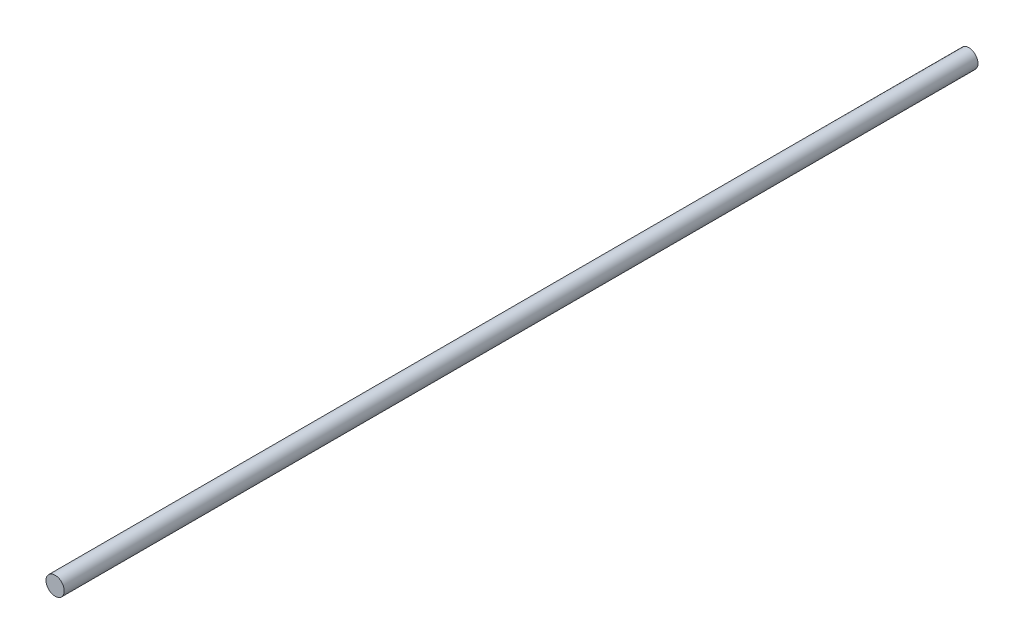
ISO-10303-21;
HEADER;
FILE_DESCRIPTION(('STEP AP214'),'2;1');
FILE_NAME('part.step','',(''),(''),'','','');
FILE_SCHEMA(('AUTOMOTIVE_DESIGN { 1 0 10303 214 1 1 1 1 }'));
ENDSEC;
DATA;
#1=APPLICATION_CONTEXT('core data for automotive mechanical design processes');
#2=APPLICATION_PROTOCOL_DEFINITION('international standard','automotive_design',2000,#1);
#3=PRODUCT_CONTEXT('',#1,'mechanical');
#4=PRODUCT('Part','Part','',(#3));
#5=PRODUCT_RELATED_PRODUCT_CATEGORY('part','',(#4));
#6=PRODUCT_DEFINITION_FORMATION('','',#4);
#7=PRODUCT_DEFINITION_CONTEXT('part definition',#1,'design');
#8=PRODUCT_DEFINITION('design','',#6,#7);
#9=PRODUCT_DEFINITION_SHAPE('','',#8);
#10=(LENGTH_UNIT() NAMED_UNIT(*) SI_UNIT(.MILLI.,.METRE.));
#11=(NAMED_UNIT(*) PLANE_ANGLE_UNIT() SI_UNIT($,.RADIAN.));
#12=(NAMED_UNIT(*) SI_UNIT($,.STERADIAN.) SOLID_ANGLE_UNIT());
#13=UNCERTAINTY_MEASURE_WITH_UNIT(LENGTH_MEASURE(1.E-05),#10,'distance_accuracy_value','');
#14=(GEOMETRIC_REPRESENTATION_CONTEXT(3) GLOBAL_UNCERTAINTY_ASSIGNED_CONTEXT((#13)) GLOBAL_UNIT_ASSIGNED_CONTEXT((#10,
#11,#12)) REPRESENTATION_CONTEXT('',''));
#15=CARTESIAN_POINT('',(0.,0.,0.));
#16=DIRECTION('',(0.,0.,1.));
#17=DIRECTION('',(1.,0.,0.));
#18=AXIS2_PLACEMENT_3D('',#15,#16,#17);
#19=CARTESIAN_POINT('',(0.,0.,400.));
#20=DIRECTION('',(0.,0.,-1.));
#21=DIRECTION('',(-1.,0.,0.));
#22=AXIS2_PLACEMENT_3D('',#19,#20,#21);
#23=CYLINDRICAL_SURFACE('',#22,4.);
#24=CARTESIAN_POINT('',(0.,0.,400.));
#25=DIRECTION('',(0.,0.,1.));
#26=DIRECTION('',(1.,0.,0.));
#27=AXIS2_PLACEMENT_3D('',#24,#25,#26);
#28=CIRCLE('',#27,4.);
#29=CARTESIAN_POINT('',(4.,0.,400.));
#30=VERTEX_POINT('',#29);
#31=EDGE_CURVE('E10',#30,#30,#28,.T.);
#32=ORIENTED_EDGE('',*,*,#31,.F.);
#33=EDGE_LOOP('',(#32));
#34=FACE_BOUND('',#33,.T.);
#35=CARTESIAN_POINT('',(0.,0.,0.));
#36=DIRECTION('',(0.,0.,1.));
#37=DIRECTION('',(1.,0.,0.));
#38=AXIS2_PLACEMENT_3D('',#35,#36,#37);
#39=CIRCLE('',#38,4.);
#40=CARTESIAN_POINT('',(4.,0.,0.));
#41=VERTEX_POINT('',#40);
#42=EDGE_CURVE('E38',#41,#41,#39,.T.);
#43=ORIENTED_EDGE('',*,*,#42,.T.);
#44=EDGE_LOOP('',(#43));
#45=FACE_BOUND('',#44,.T.);
#46=ADVANCED_FACE('F35',(#34,#45),#23,.T.);
#47=CARTESIAN_POINT('',(0.,0.,400.));
#48=DIRECTION('',(0.,0.,1.));
#49=DIRECTION('',(1.,0.,0.));
#50=AXIS2_PLACEMENT_3D('',#47,#48,#49);
#51=PLANE('',#50);
#52=ORIENTED_EDGE('',*,*,#31,.T.);
#53=EDGE_LOOP('',(#52));
#54=FACE_BOUND('',#53,.T.);
#55=ADVANCED_FACE('F51',(#54),#51,.T.);
#56=CARTESIAN_POINT('',(0.,0.,0.));
#57=DIRECTION('',(0.,0.,1.));
#58=DIRECTION('',(1.,0.,0.));
#59=AXIS2_PLACEMENT_3D('',#56,#57,#58);
#60=PLANE('',#59);
#61=ORIENTED_EDGE('',*,*,#42,.F.);
#62=EDGE_LOOP('',(#61));
#63=FACE_BOUND('',#62,.T.);
#64=ADVANCED_FACE('F49',(#63),#60,.F.);
#65=CLOSED_SHELL('',(#46,#55,#64));
#66=MANIFOLD_SOLID_BREP('B2',#65);
#67=ADVANCED_BREP_SHAPE_REPRESENTATION('',(#18,#66),#14);
#68=SHAPE_DEFINITION_REPRESENTATION(#9,#67);
ENDSEC;
END-ISO-10303-21;
